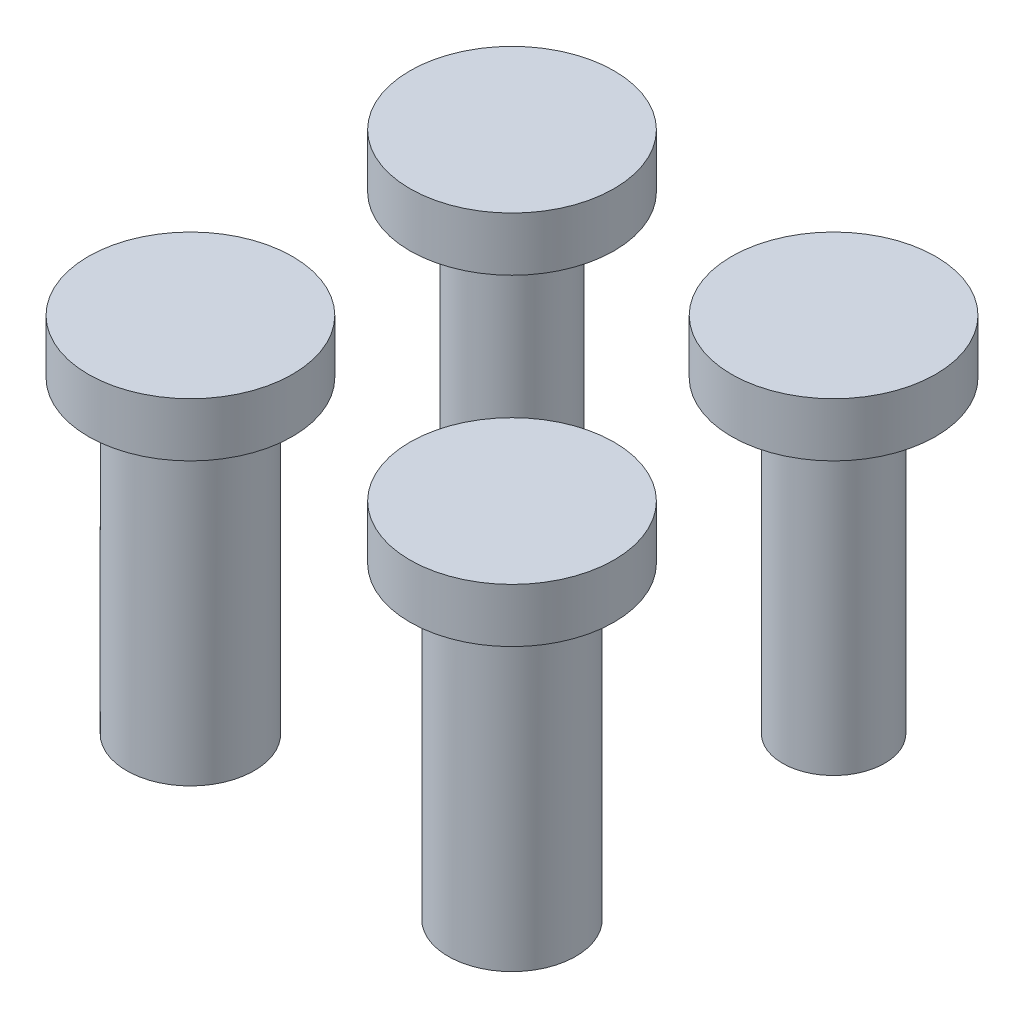
ISO-10303-21;
HEADER;
FILE_DESCRIPTION(('STEP AP214'),'2;1');
FILE_NAME('part.step','',(''),(''),'','','');
FILE_SCHEMA(('AUTOMOTIVE_DESIGN { 1 0 10303 214 1 1 1 1 }'));
ENDSEC;
DATA;
#1=APPLICATION_CONTEXT('core data for automotive mechanical design processes');
#2=APPLICATION_PROTOCOL_DEFINITION('international standard','automotive_design',2000,#1);
#3=PRODUCT_CONTEXT('',#1,'mechanical');
#4=PRODUCT('Part','Part','',(#3));
#5=PRODUCT_RELATED_PRODUCT_CATEGORY('part','',(#4));
#6=PRODUCT_DEFINITION_FORMATION('','',#4);
#7=PRODUCT_DEFINITION_CONTEXT('part definition',#1,'design');
#8=PRODUCT_DEFINITION('design','',#6,#7);
#9=PRODUCT_DEFINITION_SHAPE('','',#8);
#10=(LENGTH_UNIT() NAMED_UNIT(*) SI_UNIT(.MILLI.,.METRE.));
#11=(NAMED_UNIT(*) PLANE_ANGLE_UNIT() SI_UNIT($,.RADIAN.));
#12=(NAMED_UNIT(*) SI_UNIT($,.STERADIAN.) SOLID_ANGLE_UNIT());
#13=UNCERTAINTY_MEASURE_WITH_UNIT(LENGTH_MEASURE(1.E-05),#10,'distance_accuracy_value','');
#14=(GEOMETRIC_REPRESENTATION_CONTEXT(3) GLOBAL_UNCERTAINTY_ASSIGNED_CONTEXT((#13)) GLOBAL_UNIT_ASSIGNED_CONTEXT((#10,
#11,#12)) REPRESENTATION_CONTEXT('',''));
#15=CARTESIAN_POINT('',(0.,0.,0.));
#16=DIRECTION('',(0.,0.,1.));
#17=DIRECTION('',(1.,0.,0.));
#18=AXIS2_PLACEMENT_3D('',#15,#16,#17);
#19=CARTESIAN_POINT('',(20.,0.,20.));
#20=DIRECTION('',(0.,1.,0.));
#21=DIRECTION('',(0.,0.,1.));
#22=AXIS2_PLACEMENT_3D('',#19,#20,#21);
#23=PLANE('',#22);
#24=CARTESIAN_POINT('',(20.,0.,20.));
#25=DIRECTION('',(0.,-1.,0.));
#26=DIRECTION('',(0.,0.,-1.));
#27=AXIS2_PLACEMENT_3D('',#24,#25,#26);
#28=CIRCLE('',#27,1.675);
#29=CARTESIAN_POINT('',(20.,0.,18.325));
#30=VERTEX_POINT('',#29);
#31=EDGE_CURVE('E45',#30,#30,#28,.T.);
#32=ORIENTED_EDGE('',*,*,#31,.F.);
#33=EDGE_LOOP('',(#32));
#34=FACE_BOUND('',#33,.T.);
#35=CARTESIAN_POINT('',(20.,0.,20.));
#36=DIRECTION('',(0.,-1.,0.));
#37=DIRECTION('',(0.,0.,-1.));
#38=AXIS2_PLACEMENT_3D('',#35,#36,#37);
#39=CIRCLE('',#38,3.96875);
#40=CARTESIAN_POINT('',(20.,0.,16.03125));
#41=VERTEX_POINT('',#40);
#42=EDGE_CURVE('E59',#41,#41,#39,.T.);
#43=ORIENTED_EDGE('',*,*,#42,.T.);
#44=EDGE_LOOP('',(#43));
#45=FACE_BOUND('',#44,.T.);
#46=ADVANCED_FACE('F42',(#34,#45),#23,.F.);
#47=CARTESIAN_POINT('',(20.,12.,20.));
#48=DIRECTION('',(0.,-1.,0.));
#49=DIRECTION('',(0.,0.,-1.));
#50=AXIS2_PLACEMENT_3D('',#47,#48,#49);
#51=CYLINDRICAL_SURFACE('',#50,1.675);
#52=CARTESIAN_POINT('',(20.,12.,20.));
#53=DIRECTION('',(0.,-1.,0.));
#54=DIRECTION('',(0.,0.,-1.));
#55=AXIS2_PLACEMENT_3D('',#52,#53,#54);
#56=CIRCLE('',#55,1.675);
#57=CARTESIAN_POINT('',(20.,12.,18.325));
#58=VERTEX_POINT('',#57);
#59=EDGE_CURVE('E11',#58,#58,#56,.T.);
#60=ORIENTED_EDGE('',*,*,#59,.F.);
#61=EDGE_LOOP('',(#60));
#62=FACE_BOUND('',#61,.T.);
#63=ORIENTED_EDGE('',*,*,#31,.T.);
#64=EDGE_LOOP('',(#63));
#65=FACE_BOUND('',#64,.T.);
#66=ADVANCED_FACE('F93',(#62,#65),#51,.F.);
#67=CARTESIAN_POINT('',(20.,12.,20.));
#68=DIRECTION('',(0.,-1.,0.));
#69=DIRECTION('',(0.,0.,-1.));
#70=AXIS2_PLACEMENT_3D('',#67,#68,#69);
#71=PLANE('',#70);
#72=ORIENTED_EDGE('',*,*,#59,.T.);
#73=EDGE_LOOP('',(#72));
#74=FACE_BOUND('',#73,.T.);
#75=ADVANCED_FACE('F71',(#74),#71,.T.);
#76=CARTESIAN_POINT('',(20.,30.4153201513364,20.));
#77=DIRECTION('',(0.,-1.,0.));
#78=DIRECTION('',(0.,0.,-1.));
#79=AXIS2_PLACEMENT_3D('',#76,#77,#78);
#80=CYLINDRICAL_SURFACE('',#79,3.96875);
#81=ORIENTED_EDGE('',*,*,#42,.F.);
#82=EDGE_LOOP('',(#81));
#83=FACE_BOUND('',#82,.T.);
#84=CARTESIAN_POINT('',(20.,19.19,20.));
#85=DIRECTION('',(0.,1.,0.));
#86=DIRECTION('',(0.,0.,1.));
#87=AXIS2_PLACEMENT_3D('',#84,#85,#86);
#88=CIRCLE('',#87,3.96875);
#89=CARTESIAN_POINT('',(20.,19.19,23.96875));
#90=VERTEX_POINT('',#89);
#91=EDGE_CURVE('E60',#90,#90,#88,.F.);
#92=ORIENTED_EDGE('',*,*,#91,.T.);
#93=EDGE_LOOP('',(#92));
#94=FACE_BOUND('',#93,.T.);
#95=ADVANCED_FACE('F67',(#83,#94),#80,.T.);
#96=CARTESIAN_POINT('',(20.,22.54,20.));
#97=DIRECTION('',(0.,1.,0.));
#98=DIRECTION('',(0.,0.,1.));
#99=AXIS2_PLACEMENT_3D('',#96,#97,#98);
#100=PLANE('',#99);
#101=CARTESIAN_POINT('',(20.,22.54,20.));
#102=DIRECTION('',(0.,1.,0.));
#103=DIRECTION('',(0.,0.,1.));
#104=AXIS2_PLACEMENT_3D('',#101,#102,#103);
#105=CIRCLE('',#104,6.35);
#106=CARTESIAN_POINT('',(20.,22.54,26.35));
#107=VERTEX_POINT('',#106);
#108=EDGE_CURVE('E52',#107,#107,#105,.T.);
#109=ORIENTED_EDGE('',*,*,#108,.T.);
#110=EDGE_LOOP('',(#109));
#111=FACE_BOUND('',#110,.T.);
#112=ADVANCED_FACE('F70',(#111),#100,.T.);
#113=CARTESIAN_POINT('',(20.,22.54,20.));
#114=DIRECTION('',(0.,-1.,0.));
#115=DIRECTION('',(0.,0.,-1.));
#116=AXIS2_PLACEMENT_3D('',#113,#114,#115);
#117=CYLINDRICAL_SURFACE('',#116,6.35);
#118=ORIENTED_EDGE('',*,*,#108,.F.);
#119=EDGE_LOOP('',(#118));
#120=FACE_BOUND('',#119,.T.);
#121=CARTESIAN_POINT('',(20.,19.19,20.));
#122=DIRECTION('',(0.,1.,0.));
#123=DIRECTION('',(0.,0.,1.));
#124=AXIS2_PLACEMENT_3D('',#121,#122,#123);
#125=CIRCLE('',#124,6.35);
#126=CARTESIAN_POINT('',(20.,19.19,26.35));
#127=VERTEX_POINT('',#126);
#128=EDGE_CURVE('E56',#127,#127,#125,.T.);
#129=ORIENTED_EDGE('',*,*,#128,.T.);
#130=EDGE_LOOP('',(#129));
#131=FACE_BOUND('',#130,.T.);
#132=ADVANCED_FACE('F78',(#120,#131),#117,.T.);
#133=CARTESIAN_POINT('',(20.,19.19,20.));
#134=DIRECTION('',(0.,1.,0.));
#135=DIRECTION('',(0.,0.,1.));
#136=AXIS2_PLACEMENT_3D('',#133,#134,#135);
#137=PLANE('',#136);
#138=ORIENTED_EDGE('',*,*,#91,.F.);
#139=EDGE_LOOP('',(#138));
#140=FACE_BOUND('',#139,.T.);
#141=ORIENTED_EDGE('',*,*,#128,.F.);
#142=EDGE_LOOP('',(#141));
#143=FACE_BOUND('',#142,.T.);
#144=ADVANCED_FACE('F75',(#140,#143),#137,.F.);
#145=CLOSED_SHELL('',(#46,#66,#75,#95,#112,#132,#144));
#146=MANIFOLD_SOLID_BREP('B2',#145);
#147=CARTESIAN_POINT('',(0.,0.,20.));
#148=DIRECTION('',(0.,1.,0.));
#149=DIRECTION('',(0.,0.,1.));
#150=AXIS2_PLACEMENT_3D('',#147,#148,#149);
#151=PLANE('',#150);
#152=CARTESIAN_POINT('',(0.,0.,20.));
#153=DIRECTION('',(0.,-1.,0.));
#154=DIRECTION('',(0.,0.,-1.));
#155=AXIS2_PLACEMENT_3D('',#152,#153,#154);
#156=CIRCLE('',#155,1.675);
#157=CARTESIAN_POINT('',(0.,0.,18.325));
#158=VERTEX_POINT('',#157);
#159=EDGE_CURVE('E160',#158,#158,#156,.T.);
#160=ORIENTED_EDGE('',*,*,#159,.F.);
#161=EDGE_LOOP('',(#160));
#162=FACE_BOUND('',#161,.T.);
#163=CARTESIAN_POINT('',(0.,0.,20.));
#164=DIRECTION('',(0.,-1.,0.));
#165=DIRECTION('',(0.,0.,-1.));
#166=AXIS2_PLACEMENT_3D('',#163,#164,#165);
#167=CIRCLE('',#166,3.96875);
#168=CARTESIAN_POINT('',(0.,0.,16.03125));
#169=VERTEX_POINT('',#168);
#170=EDGE_CURVE('E174',#169,#169,#167,.T.);
#171=ORIENTED_EDGE('',*,*,#170,.T.);
#172=EDGE_LOOP('',(#171));
#173=FACE_BOUND('',#172,.T.);
#174=ADVANCED_FACE('F157',(#162,#173),#151,.F.);
#175=CARTESIAN_POINT('',(0.,12.,20.));
#176=DIRECTION('',(0.,-1.,0.));
#177=DIRECTION('',(0.,0.,-1.));
#178=AXIS2_PLACEMENT_3D('',#175,#176,#177);
#179=CYLINDRICAL_SURFACE('',#178,1.675);
#180=CARTESIAN_POINT('',(0.,12.,20.));
#181=DIRECTION('',(0.,-1.,0.));
#182=DIRECTION('',(0.,0.,-1.));
#183=AXIS2_PLACEMENT_3D('',#180,#181,#182);
#184=CIRCLE('',#183,1.675);
#185=CARTESIAN_POINT('',(0.,12.,18.325));
#186=VERTEX_POINT('',#185);
#187=EDGE_CURVE('E41',#186,#186,#184,.T.);
#188=ORIENTED_EDGE('',*,*,#187,.F.);
#189=EDGE_LOOP('',(#188));
#190=FACE_BOUND('',#189,.T.);
#191=ORIENTED_EDGE('',*,*,#159,.T.);
#192=EDGE_LOOP('',(#191));
#193=FACE_BOUND('',#192,.T.);
#194=ADVANCED_FACE('F208',(#190,#193),#179,.F.);
#195=CARTESIAN_POINT('',(0.,12.,20.));
#196=DIRECTION('',(0.,-1.,0.));
#197=DIRECTION('',(0.,0.,-1.));
#198=AXIS2_PLACEMENT_3D('',#195,#196,#197);
#199=PLANE('',#198);
#200=ORIENTED_EDGE('',*,*,#187,.T.);
#201=EDGE_LOOP('',(#200));
#202=FACE_BOUND('',#201,.T.);
#203=ADVANCED_FACE('F186',(#202),#199,.T.);
#204=CARTESIAN_POINT('',(0.,30.4153201513364,20.));
#205=DIRECTION('',(0.,-1.,0.));
#206=DIRECTION('',(0.,0.,-1.));
#207=AXIS2_PLACEMENT_3D('',#204,#205,#206);
#208=CYLINDRICAL_SURFACE('',#207,3.96875);
#209=ORIENTED_EDGE('',*,*,#170,.F.);
#210=EDGE_LOOP('',(#209));
#211=FACE_BOUND('',#210,.T.);
#212=CARTESIAN_POINT('',(0.,19.19,20.));
#213=DIRECTION('',(0.,1.,0.));
#214=DIRECTION('',(0.,0.,1.));
#215=AXIS2_PLACEMENT_3D('',#212,#213,#214);
#216=CIRCLE('',#215,3.96875);
#217=CARTESIAN_POINT('',(0.,19.19,23.96875));
#218=VERTEX_POINT('',#217);
#219=EDGE_CURVE('E175',#218,#218,#216,.F.);
#220=ORIENTED_EDGE('',*,*,#219,.T.);
#221=EDGE_LOOP('',(#220));
#222=FACE_BOUND('',#221,.T.);
#223=ADVANCED_FACE('F182',(#211,#222),#208,.T.);
#224=CARTESIAN_POINT('',(0.,22.54,20.));
#225=DIRECTION('',(0.,1.,0.));
#226=DIRECTION('',(0.,0.,1.));
#227=AXIS2_PLACEMENT_3D('',#224,#225,#226);
#228=PLANE('',#227);
#229=CARTESIAN_POINT('',(0.,22.54,20.));
#230=DIRECTION('',(0.,1.,0.));
#231=DIRECTION('',(0.,0.,1.));
#232=AXIS2_PLACEMENT_3D('',#229,#230,#231);
#233=CIRCLE('',#232,6.35);
#234=CARTESIAN_POINT('',(0.,22.54,26.35));
#235=VERTEX_POINT('',#234);
#236=EDGE_CURVE('E167',#235,#235,#233,.T.);
#237=ORIENTED_EDGE('',*,*,#236,.T.);
#238=EDGE_LOOP('',(#237));
#239=FACE_BOUND('',#238,.T.);
#240=ADVANCED_FACE('F185',(#239),#228,.T.);
#241=CARTESIAN_POINT('',(0.,22.54,20.));
#242=DIRECTION('',(0.,-1.,0.));
#243=DIRECTION('',(0.,0.,-1.));
#244=AXIS2_PLACEMENT_3D('',#241,#242,#243);
#245=CYLINDRICAL_SURFACE('',#244,6.35);
#246=ORIENTED_EDGE('',*,*,#236,.F.);
#247=EDGE_LOOP('',(#246));
#248=FACE_BOUND('',#247,.T.);
#249=CARTESIAN_POINT('',(0.,19.19,20.));
#250=DIRECTION('',(0.,1.,0.));
#251=DIRECTION('',(0.,0.,1.));
#252=AXIS2_PLACEMENT_3D('',#249,#250,#251);
#253=CIRCLE('',#252,6.35);
#254=CARTESIAN_POINT('',(0.,19.19,26.35));
#255=VERTEX_POINT('',#254);
#256=EDGE_CURVE('E171',#255,#255,#253,.T.);
#257=ORIENTED_EDGE('',*,*,#256,.T.);
#258=EDGE_LOOP('',(#257));
#259=FACE_BOUND('',#258,.T.);
#260=ADVANCED_FACE('F193',(#248,#259),#245,.T.);
#261=CARTESIAN_POINT('',(0.,19.19,20.));
#262=DIRECTION('',(0.,1.,0.));
#263=DIRECTION('',(0.,0.,1.));
#264=AXIS2_PLACEMENT_3D('',#261,#262,#263);
#265=PLANE('',#264);
#266=ORIENTED_EDGE('',*,*,#219,.F.);
#267=EDGE_LOOP('',(#266));
#268=FACE_BOUND('',#267,.T.);
#269=ORIENTED_EDGE('',*,*,#256,.F.);
#270=EDGE_LOOP('',(#269));
#271=FACE_BOUND('',#270,.T.);
#272=ADVANCED_FACE('F190',(#268,#271),#265,.F.);
#273=CLOSED_SHELL('',(#174,#194,#203,#223,#240,#260,#272));
#274=MANIFOLD_SOLID_BREP('B6',#273);
#275=CARTESIAN_POINT('',(20.,20.,0.));
#276=DIRECTION('',(0.,-1.,0.));
#277=DIRECTION('',(0.,0.,-1.));
#278=AXIS2_PLACEMENT_3D('',#275,#276,#277);
#279=CYLINDRICAL_SURFACE('',#278,3.175);
#280=CARTESIAN_POINT('',(20.,0.,0.));
#281=DIRECTION('',(0.,1.,0.));
#282=DIRECTION('',(0.,0.,1.));
#283=AXIS2_PLACEMENT_3D('',#280,#281,#282);
#284=CIRCLE('',#283,3.175);
#285=CARTESIAN_POINT('',(20.,0.,3.175));
#286=VERTEX_POINT('',#285);
#287=EDGE_CURVE('E277',#286,#286,#284,.T.);
#288=ORIENTED_EDGE('',*,*,#287,.T.);
#289=EDGE_LOOP('',(#288));
#290=FACE_BOUND('',#289,.T.);
#291=CARTESIAN_POINT('',(20.,19.19,0.));
#292=DIRECTION('',(0.,1.,0.));
#293=DIRECTION('',(0.,0.,1.));
#294=AXIS2_PLACEMENT_3D('',#291,#292,#293);
#295=CIRCLE('',#294,3.175);
#296=CARTESIAN_POINT('',(20.,19.19,3.175));
#297=VERTEX_POINT('',#296);
#298=EDGE_CURVE('E156',#297,#297,#295,.T.);
#299=ORIENTED_EDGE('',*,*,#298,.F.);
#300=EDGE_LOOP('',(#299));
#301=FACE_BOUND('',#300,.T.);
#302=ADVANCED_FACE('F271',(#290,#301),#279,.T.);
#303=CARTESIAN_POINT('',(20.,0.,0.));
#304=DIRECTION('',(0.,1.,0.));
#305=DIRECTION('',(0.,0.,1.));
#306=AXIS2_PLACEMENT_3D('',#303,#304,#305);
#307=PLANE('',#306);
#308=CARTESIAN_POINT('',(20.,0.,0.));
#309=DIRECTION('',(0.,-1.,0.));
#310=DIRECTION('',(0.,0.,-1.));
#311=AXIS2_PLACEMENT_3D('',#308,#309,#310);
#312=CIRCLE('',#311,1.675);
#313=CARTESIAN_POINT('',(20.,0.,-1.675));
#314=VERTEX_POINT('',#313);
#315=EDGE_CURVE('E285',#314,#314,#312,.T.);
#316=ORIENTED_EDGE('',*,*,#315,.F.);
#317=EDGE_LOOP('',(#316));
#318=FACE_BOUND('',#317,.T.);
#319=ORIENTED_EDGE('',*,*,#287,.F.);
#320=EDGE_LOOP('',(#319));
#321=FACE_BOUND('',#320,.T.);
#322=ADVANCED_FACE('F314',(#318,#321),#307,.F.);
#323=CARTESIAN_POINT('',(20.,12.,0.));
#324=DIRECTION('',(0.,-1.,0.));
#325=DIRECTION('',(0.,0.,-1.));
#326=AXIS2_PLACEMENT_3D('',#323,#324,#325);
#327=CYLINDRICAL_SURFACE('',#326,1.675);
#328=CARTESIAN_POINT('',(20.,12.,0.));
#329=DIRECTION('',(0.,-1.,0.));
#330=DIRECTION('',(0.,0.,-1.));
#331=AXIS2_PLACEMENT_3D('',#328,#329,#330);
#332=CIRCLE('',#331,1.675);
#333=CARTESIAN_POINT('',(20.,12.,-1.675));
#334=VERTEX_POINT('',#333);
#335=EDGE_CURVE('E281',#334,#334,#332,.T.);
#336=ORIENTED_EDGE('',*,*,#335,.F.);
#337=EDGE_LOOP('',(#336));
#338=FACE_BOUND('',#337,.T.);
#339=ORIENTED_EDGE('',*,*,#315,.T.);
#340=EDGE_LOOP('',(#339));
#341=FACE_BOUND('',#340,.T.);
#342=ADVANCED_FACE('F310',(#338,#341),#327,.F.);
#343=CARTESIAN_POINT('',(20.,12.,0.));
#344=DIRECTION('',(0.,-1.,0.));
#345=DIRECTION('',(0.,0.,-1.));
#346=AXIS2_PLACEMENT_3D('',#343,#344,#345);
#347=PLANE('',#346);
#348=ORIENTED_EDGE('',*,*,#335,.T.);
#349=EDGE_LOOP('',(#348));
#350=FACE_BOUND('',#349,.T.);
#351=ADVANCED_FACE('F302',(#350),#347,.T.);
#352=CARTESIAN_POINT('',(20.,19.19,0.));
#353=DIRECTION('',(0.,1.,0.));
#354=DIRECTION('',(0.,0.,1.));
#355=AXIS2_PLACEMENT_3D('',#352,#353,#354);
#356=PLANE('',#355);
#357=CARTESIAN_POINT('',(20.,19.19,0.));
#358=DIRECTION('',(0.,1.,0.));
#359=DIRECTION('',(0.,0.,1.));
#360=AXIS2_PLACEMENT_3D('',#357,#358,#359);
#361=CIRCLE('',#360,6.35);
#362=CARTESIAN_POINT('',(20.,19.19,6.35));
#363=VERTEX_POINT('',#362);
#364=EDGE_CURVE('E293',#363,#363,#361,.T.);
#365=ORIENTED_EDGE('',*,*,#364,.F.);
#366=EDGE_LOOP('',(#365));
#367=FACE_BOUND('',#366,.T.);
#368=ORIENTED_EDGE('',*,*,#298,.T.);
#369=EDGE_LOOP('',(#368));
#370=FACE_BOUND('',#369,.T.);
#371=ADVANCED_FACE('F299',(#367,#370),#356,.F.);
#372=CARTESIAN_POINT('',(20.,22.54,0.));
#373=DIRECTION('',(0.,1.,0.));
#374=DIRECTION('',(0.,0.,1.));
#375=AXIS2_PLACEMENT_3D('',#372,#373,#374);
#376=PLANE('',#375);
#377=CARTESIAN_POINT('',(20.,22.54,0.));
#378=DIRECTION('',(0.,1.,0.));
#379=DIRECTION('',(0.,0.,1.));
#380=AXIS2_PLACEMENT_3D('',#377,#378,#379);
#381=CIRCLE('',#380,6.35);
#382=CARTESIAN_POINT('',(20.,22.54,6.35));
#383=VERTEX_POINT('',#382);
#384=EDGE_CURVE('E289',#383,#383,#381,.T.);
#385=ORIENTED_EDGE('',*,*,#384,.T.);
#386=EDGE_LOOP('',(#385));
#387=FACE_BOUND('',#386,.T.);
#388=ADVANCED_FACE('F301',(#387),#376,.T.);
#389=CARTESIAN_POINT('',(20.,22.54,0.));
#390=DIRECTION('',(0.,-1.,0.));
#391=DIRECTION('',(0.,0.,-1.));
#392=AXIS2_PLACEMENT_3D('',#389,#390,#391);
#393=CYLINDRICAL_SURFACE('',#392,6.35);
#394=ORIENTED_EDGE('',*,*,#384,.F.);
#395=EDGE_LOOP('',(#394));
#396=FACE_BOUND('',#395,.T.);
#397=ORIENTED_EDGE('',*,*,#364,.T.);
#398=EDGE_LOOP('',(#397));
#399=FACE_BOUND('',#398,.T.);
#400=ADVANCED_FACE('F297',(#396,#399),#393,.T.);
#401=CLOSED_SHELL('',(#302,#322,#342,#351,#371,#388,#400));
#402=MANIFOLD_SOLID_BREP('B36',#401);
#403=CARTESIAN_POINT('',(0.,20.,0.));
#404=DIRECTION('',(0.,-1.,0.));
#405=DIRECTION('',(0.,0.,-1.));
#406=AXIS2_PLACEMENT_3D('',#403,#404,#405);
#407=CYLINDRICAL_SURFACE('',#406,3.175);
#408=CARTESIAN_POINT('',(0.,0.,0.));
#409=DIRECTION('',(0.,1.,0.));
#410=DIRECTION('',(0.,0.,1.));
#411=AXIS2_PLACEMENT_3D('',#408,#409,#410);
#412=CIRCLE('',#411,3.175);
#413=CARTESIAN_POINT('',(0.,0.,3.175));
#414=VERTEX_POINT('',#413);
#415=EDGE_CURVE('E381',#414,#414,#412,.T.);
#416=ORIENTED_EDGE('',*,*,#415,.T.);
#417=EDGE_LOOP('',(#416));
#418=FACE_BOUND('',#417,.T.);
#419=CARTESIAN_POINT('',(0.,19.19,0.));
#420=DIRECTION('',(0.,1.,0.));
#421=DIRECTION('',(0.,0.,1.));
#422=AXIS2_PLACEMENT_3D('',#419,#420,#421);
#423=CIRCLE('',#422,3.175);
#424=CARTESIAN_POINT('',(0.,19.19,3.175));
#425=VERTEX_POINT('',#424);
#426=EDGE_CURVE('E270',#425,#425,#423,.T.);
#427=ORIENTED_EDGE('',*,*,#426,.F.);
#428=EDGE_LOOP('',(#427));
#429=FACE_BOUND('',#428,.T.);
#430=ADVANCED_FACE('F375',(#418,#429),#407,.T.);
#431=CARTESIAN_POINT('',(0.,0.,0.));
#432=DIRECTION('',(0.,1.,0.));
#433=DIRECTION('',(0.,0.,1.));
#434=AXIS2_PLACEMENT_3D('',#431,#432,#433);
#435=PLANE('',#434);
#436=CARTESIAN_POINT('',(0.,0.,0.));
#437=DIRECTION('',(0.,-1.,0.));
#438=DIRECTION('',(0.,0.,-1.));
#439=AXIS2_PLACEMENT_3D('',#436,#437,#438);
#440=CIRCLE('',#439,1.675);
#441=CARTESIAN_POINT('',(0.,0.,-1.675));
#442=VERTEX_POINT('',#441);
#443=EDGE_CURVE('E389',#442,#442,#440,.T.);
#444=ORIENTED_EDGE('',*,*,#443,.F.);
#445=EDGE_LOOP('',(#444));
#446=FACE_BOUND('',#445,.T.);
#447=ORIENTED_EDGE('',*,*,#415,.F.);
#448=EDGE_LOOP('',(#447));
#449=FACE_BOUND('',#448,.T.);
#450=ADVANCED_FACE('F418',(#446,#449),#435,.F.);
#451=CARTESIAN_POINT('',(0.,12.,0.));
#452=DIRECTION('',(0.,-1.,0.));
#453=DIRECTION('',(0.,0.,-1.));
#454=AXIS2_PLACEMENT_3D('',#451,#452,#453);
#455=CYLINDRICAL_SURFACE('',#454,1.675);
#456=CARTESIAN_POINT('',(0.,12.,0.));
#457=DIRECTION('',(0.,-1.,0.));
#458=DIRECTION('',(0.,0.,-1.));
#459=AXIS2_PLACEMENT_3D('',#456,#457,#458);
#460=CIRCLE('',#459,1.675);
#461=CARTESIAN_POINT('',(0.,12.,-1.675));
#462=VERTEX_POINT('',#461);
#463=EDGE_CURVE('E385',#462,#462,#460,.T.);
#464=ORIENTED_EDGE('',*,*,#463,.F.);
#465=EDGE_LOOP('',(#464));
#466=FACE_BOUND('',#465,.T.);
#467=ORIENTED_EDGE('',*,*,#443,.T.);
#468=EDGE_LOOP('',(#467));
#469=FACE_BOUND('',#468,.T.);
#470=ADVANCED_FACE('F414',(#466,#469),#455,.F.);
#471=CARTESIAN_POINT('',(0.,12.,0.));
#472=DIRECTION('',(0.,-1.,0.));
#473=DIRECTION('',(0.,0.,-1.));
#474=AXIS2_PLACEMENT_3D('',#471,#472,#473);
#475=PLANE('',#474);
#476=ORIENTED_EDGE('',*,*,#463,.T.);
#477=EDGE_LOOP('',(#476));
#478=FACE_BOUND('',#477,.T.);
#479=ADVANCED_FACE('F406',(#478),#475,.T.);
#480=CARTESIAN_POINT('',(0.,19.19,0.));
#481=DIRECTION('',(0.,1.,0.));
#482=DIRECTION('',(0.,0.,1.));
#483=AXIS2_PLACEMENT_3D('',#480,#481,#482);
#484=PLANE('',#483);
#485=CARTESIAN_POINT('',(0.,19.19,0.));
#486=DIRECTION('',(0.,1.,0.));
#487=DIRECTION('',(0.,0.,1.));
#488=AXIS2_PLACEMENT_3D('',#485,#486,#487);
#489=CIRCLE('',#488,6.35);
#490=CARTESIAN_POINT('',(0.,19.19,6.35));
#491=VERTEX_POINT('',#490);
#492=EDGE_CURVE('E397',#491,#491,#489,.T.);
#493=ORIENTED_EDGE('',*,*,#492,.F.);
#494=EDGE_LOOP('',(#493));
#495=FACE_BOUND('',#494,.T.);
#496=ORIENTED_EDGE('',*,*,#426,.T.);
#497=EDGE_LOOP('',(#496));
#498=FACE_BOUND('',#497,.T.);
#499=ADVANCED_FACE('F403',(#495,#498),#484,.F.);
#500=CARTESIAN_POINT('',(0.,22.54,0.));
#501=DIRECTION('',(0.,1.,0.));
#502=DIRECTION('',(0.,0.,1.));
#503=AXIS2_PLACEMENT_3D('',#500,#501,#502);
#504=PLANE('',#503);
#505=CARTESIAN_POINT('',(0.,22.54,0.));
#506=DIRECTION('',(0.,1.,0.));
#507=DIRECTION('',(0.,0.,1.));
#508=AXIS2_PLACEMENT_3D('',#505,#506,#507);
#509=CIRCLE('',#508,6.35);
#510=CARTESIAN_POINT('',(0.,22.54,6.35));
#511=VERTEX_POINT('',#510);
#512=EDGE_CURVE('E393',#511,#511,#509,.T.);
#513=ORIENTED_EDGE('',*,*,#512,.T.);
#514=EDGE_LOOP('',(#513));
#515=FACE_BOUND('',#514,.T.);
#516=ADVANCED_FACE('F405',(#515),#504,.T.);
#517=CARTESIAN_POINT('',(0.,22.54,0.));
#518=DIRECTION('',(0.,-1.,0.));
#519=DIRECTION('',(0.,0.,-1.));
#520=AXIS2_PLACEMENT_3D('',#517,#518,#519);
#521=CYLINDRICAL_SURFACE('',#520,6.35);
#522=ORIENTED_EDGE('',*,*,#512,.F.);
#523=EDGE_LOOP('',(#522));
#524=FACE_BOUND('',#523,.T.);
#525=ORIENTED_EDGE('',*,*,#492,.T.);
#526=EDGE_LOOP('',(#525));
#527=FACE_BOUND('',#526,.T.);
#528=ADVANCED_FACE('F401',(#524,#527),#521,.T.);
#529=CLOSED_SHELL('',(#430,#450,#470,#479,#499,#516,#528));
#530=MANIFOLD_SOLID_BREP('B151',#529);
#531=ADVANCED_BREP_SHAPE_REPRESENTATION('',(#18,#146,#274,#402,#530),#14);
#532=SHAPE_DEFINITION_REPRESENTATION(#9,#531);
ENDSEC;
END-ISO-10303-21;
